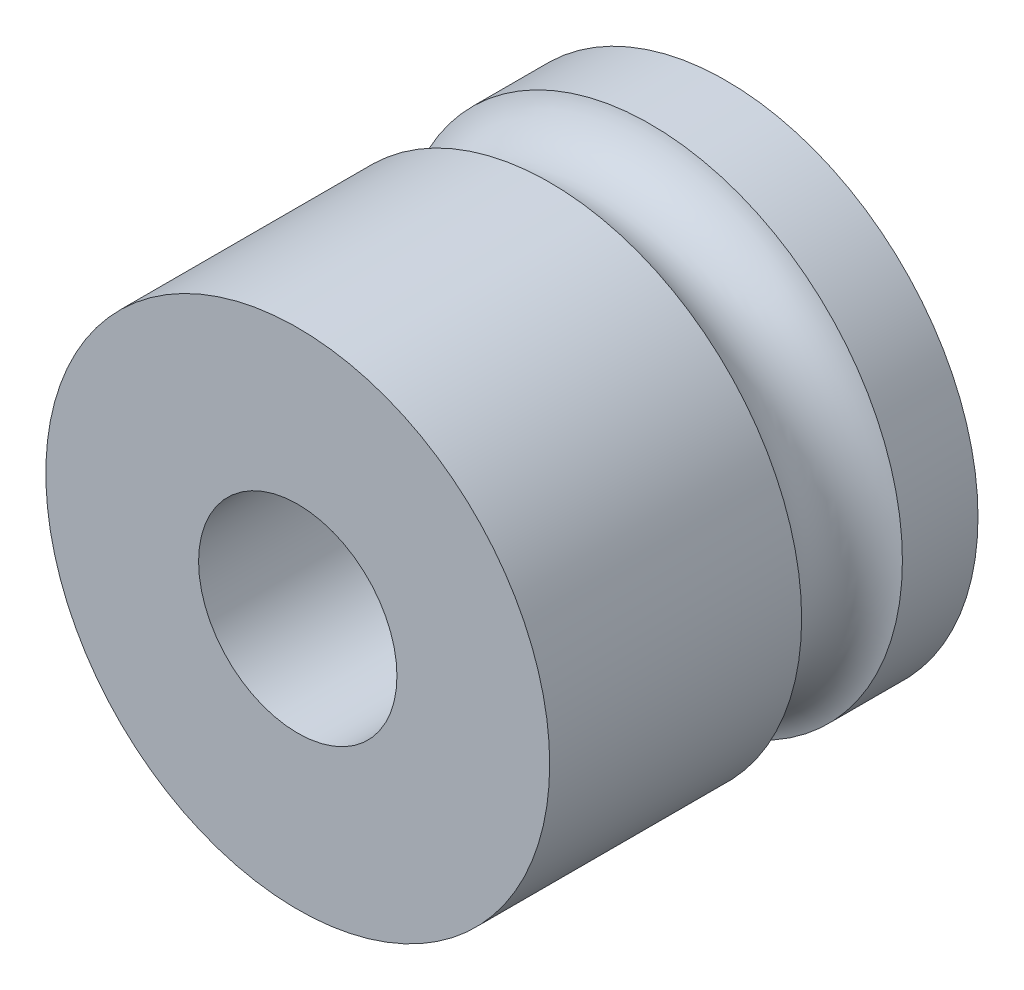
ISO-10303-21;
HEADER;
FILE_DESCRIPTION(('STEP AP214'),'2;1');
FILE_NAME('part.step','',(''),(''),'','','');
FILE_SCHEMA(('AUTOMOTIVE_DESIGN { 1 0 10303 214 1 1 1 1 }'));
ENDSEC;
DATA;
#1=APPLICATION_CONTEXT('core data for automotive mechanical design processes');
#2=APPLICATION_PROTOCOL_DEFINITION('international standard','automotive_design',2000,#1);
#3=PRODUCT_CONTEXT('',#1,'mechanical');
#4=PRODUCT('Part','Part','',(#3));
#5=PRODUCT_RELATED_PRODUCT_CATEGORY('part','',(#4));
#6=PRODUCT_DEFINITION_FORMATION('','',#4);
#7=PRODUCT_DEFINITION_CONTEXT('part definition',#1,'design');
#8=PRODUCT_DEFINITION('design','',#6,#7);
#9=PRODUCT_DEFINITION_SHAPE('','',#8);
#10=(LENGTH_UNIT() NAMED_UNIT(*) SI_UNIT(.MILLI.,.METRE.));
#11=(NAMED_UNIT(*) PLANE_ANGLE_UNIT() SI_UNIT($,.RADIAN.));
#12=(NAMED_UNIT(*) SI_UNIT($,.STERADIAN.) SOLID_ANGLE_UNIT());
#13=UNCERTAINTY_MEASURE_WITH_UNIT(LENGTH_MEASURE(1.E-05),#10,'distance_accuracy_value','');
#14=(GEOMETRIC_REPRESENTATION_CONTEXT(3) GLOBAL_UNCERTAINTY_ASSIGNED_CONTEXT((#13)) GLOBAL_UNIT_ASSIGNED_CONTEXT((#10,
#11,#12)) REPRESENTATION_CONTEXT('',''));
#15=CARTESIAN_POINT('',(0.,0.,0.));
#16=DIRECTION('',(0.,0.,1.));
#17=DIRECTION('',(1.,0.,0.));
#18=AXIS2_PLACEMENT_3D('',#15,#16,#17);
#19=CARTESIAN_POINT('',(4.425,0.,0.));
#20=DIRECTION('',(0.,0.,-1.));
#21=DIRECTION('',(-1.,0.,0.));
#22=AXIS2_PLACEMENT_3D('',#19,#20,#21);
#23=PLANE('',#22);
#24=CARTESIAN_POINT('',(0.,0.,0.));
#25=DIRECTION('',(0.,0.,1.));
#26=DIRECTION('',(1.,0.,0.));
#27=AXIS2_PLACEMENT_3D('',#24,#25,#26);
#28=CIRCLE('',#27,6.35);
#29=CARTESIAN_POINT('',(6.35,0.,0.));
#30=VERTEX_POINT('',#29);
#31=EDGE_CURVE('E22',#30,#30,#28,.T.);
#32=ORIENTED_EDGE('',*,*,#31,.F.);
#33=EDGE_LOOP('',(#32));
#34=FACE_BOUND('',#33,.T.);
#35=CARTESIAN_POINT('',(0.,0.,0.));
#36=DIRECTION('',(0.,0.,1.));
#37=DIRECTION('',(1.,0.,0.));
#38=AXIS2_PLACEMENT_3D('',#35,#36,#37);
#39=CIRCLE('',#38,2.5);
#40=CARTESIAN_POINT('',(2.5,0.,0.));
#41=VERTEX_POINT('',#40);
#42=EDGE_CURVE('E9',#41,#41,#39,.T.);
#43=ORIENTED_EDGE('',*,*,#42,.T.);
#44=EDGE_LOOP('',(#43));
#45=FACE_BOUND('',#44,.T.);
#46=ADVANCED_FACE('F14',(#34,#45),#23,.T.);
#47=CARTESIAN_POINT('',(0.,0.,0.952499999999998));
#48=DIRECTION('',(0.,0.,1.));
#49=DIRECTION('',(1.,0.,0.));
#50=AXIS2_PLACEMENT_3D('',#47,#48,#49);
#51=CYLINDRICAL_SURFACE('',#50,6.35);
#52=CARTESIAN_POINT('',(0.,0.,1.905));
#53=DIRECTION('',(0.,0.,1.));
#54=DIRECTION('',(1.,0.,0.));
#55=AXIS2_PLACEMENT_3D('',#52,#53,#54);
#56=CIRCLE('',#55,6.35);
#57=CARTESIAN_POINT('',(6.35,0.,1.905));
#58=VERTEX_POINT('',#57);
#59=EDGE_CURVE('E27',#58,#58,#56,.T.);
#60=ORIENTED_EDGE('',*,*,#59,.F.);
#61=EDGE_LOOP('',(#60));
#62=FACE_BOUND('',#61,.T.);
#63=ORIENTED_EDGE('',*,*,#31,.T.);
#64=EDGE_LOOP('',(#63));
#65=FACE_BOUND('',#64,.T.);
#66=ADVANCED_FACE('F57',(#62,#65),#51,.T.);
#67=CARTESIAN_POINT('',(0.,0.,3.175));
#68=DIRECTION('',(0.,0.,1.));
#69=DIRECTION('',(1.,0.,0.));
#70=AXIS2_PLACEMENT_3D('',#67,#68,#69);
#71=TOROIDAL_SURFACE('',#70,6.72041666666667,1.32291666666667);
#72=ORIENTED_EDGE('',*,*,#59,.T.);
#73=EDGE_LOOP('',(#72));
#74=FACE_BOUND('',#73,.T.);
#75=CARTESIAN_POINT('',(0.,0.,4.445));
#76=DIRECTION('',(0.,0.,1.));
#77=DIRECTION('',(1.,0.,0.));
#78=AXIS2_PLACEMENT_3D('',#75,#76,#77);
#79=CIRCLE('',#78,6.35);
#80=CARTESIAN_POINT('',(6.35,0.,4.445));
#81=VERTEX_POINT('',#80);
#82=EDGE_CURVE('E32',#81,#81,#79,.T.);
#83=ORIENTED_EDGE('',*,*,#82,.F.);
#84=EDGE_LOOP('',(#83));
#85=FACE_BOUND('',#84,.T.);
#86=ADVANCED_FACE('F52',(#74,#85),#71,.F.);
#87=CARTESIAN_POINT('',(0.,0.,7.62));
#88=DIRECTION('',(0.,0.,1.));
#89=DIRECTION('',(1.,0.,0.));
#90=AXIS2_PLACEMENT_3D('',#87,#88,#89);
#91=CYLINDRICAL_SURFACE('',#90,6.35);
#92=CARTESIAN_POINT('',(0.,0.,10.795));
#93=DIRECTION('',(0.,0.,1.));
#94=DIRECTION('',(1.,0.,0.));
#95=AXIS2_PLACEMENT_3D('',#92,#93,#94);
#96=CIRCLE('',#95,6.35);
#97=CARTESIAN_POINT('',(6.35,0.,10.795));
#98=VERTEX_POINT('',#97);
#99=EDGE_CURVE('E34',#98,#98,#96,.T.);
#100=ORIENTED_EDGE('',*,*,#99,.F.);
#101=EDGE_LOOP('',(#100));
#102=FACE_BOUND('',#101,.T.);
#103=ORIENTED_EDGE('',*,*,#82,.T.);
#104=EDGE_LOOP('',(#103));
#105=FACE_BOUND('',#104,.T.);
#106=ADVANCED_FACE('F16',(#102,#105),#91,.T.);
#107=CARTESIAN_POINT('',(4.425,0.,10.795));
#108=DIRECTION('',(0.,0.,1.));
#109=DIRECTION('',(1.,0.,0.));
#110=AXIS2_PLACEMENT_3D('',#107,#108,#109);
#111=PLANE('',#110);
#112=CARTESIAN_POINT('',(0.,0.,10.795));
#113=DIRECTION('',(0.,0.,1.));
#114=DIRECTION('',(1.,0.,0.));
#115=AXIS2_PLACEMENT_3D('',#112,#113,#114);
#116=CIRCLE('',#115,2.5);
#117=CARTESIAN_POINT('',(2.5,0.,10.795));
#118=VERTEX_POINT('',#117);
#119=EDGE_CURVE('E18',#118,#118,#116,.T.);
#120=ORIENTED_EDGE('',*,*,#119,.F.);
#121=EDGE_LOOP('',(#120));
#122=FACE_BOUND('',#121,.T.);
#123=ORIENTED_EDGE('',*,*,#99,.T.);
#124=EDGE_LOOP('',(#123));
#125=FACE_BOUND('',#124,.T.);
#126=ADVANCED_FACE('F43',(#122,#125),#111,.T.);
#127=CARTESIAN_POINT('',(0.,0.,5.3975));
#128=DIRECTION('',(0.,0.,1.));
#129=DIRECTION('',(1.,0.,0.));
#130=AXIS2_PLACEMENT_3D('',#127,#128,#129);
#131=CYLINDRICAL_SURFACE('',#130,2.5);
#132=ORIENTED_EDGE('',*,*,#42,.F.);
#133=EDGE_LOOP('',(#132));
#134=FACE_BOUND('',#133,.T.);
#135=ORIENTED_EDGE('',*,*,#119,.T.);
#136=EDGE_LOOP('',(#135));
#137=FACE_BOUND('',#136,.T.);
#138=ADVANCED_FACE('F41',(#134,#137),#131,.F.);
#139=CLOSED_SHELL('',(#46,#66,#86,#106,#126,#138));
#140=MANIFOLD_SOLID_BREP('B1',#139);
#141=ADVANCED_BREP_SHAPE_REPRESENTATION('',(#18,#140),#14);
#142=SHAPE_DEFINITION_REPRESENTATION(#9,#141);
ENDSEC;
END-ISO-10303-21;
